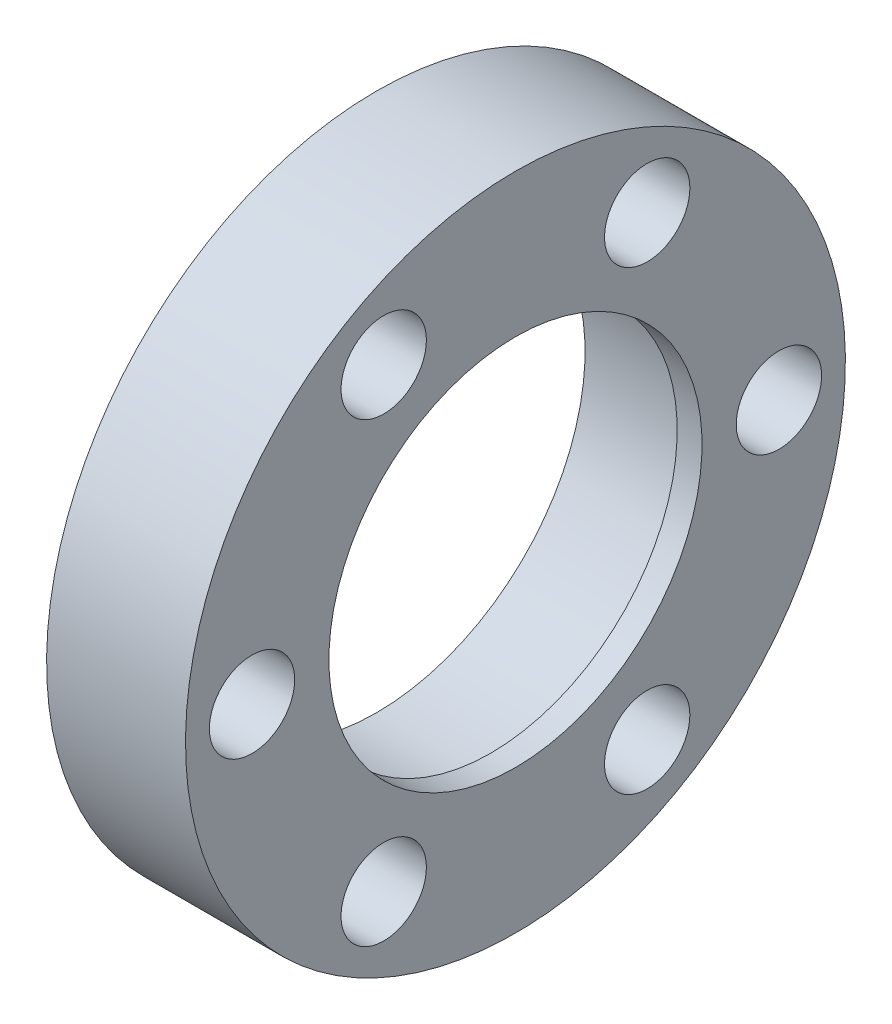
ISO-10303-21;
HEADER;
FILE_DESCRIPTION(('STEP AP214'),'2;1');
FILE_NAME('part.step','',(''),(''),'','','');
FILE_SCHEMA(('AUTOMOTIVE_DESIGN { 1 0 10303 214 1 1 1 1 }'));
ENDSEC;
DATA;
#1=APPLICATION_CONTEXT('core data for automotive mechanical design processes');
#2=APPLICATION_PROTOCOL_DEFINITION('international standard','automotive_design',2000,#1);
#3=PRODUCT_CONTEXT('',#1,'mechanical');
#4=PRODUCT('Part','Part','',(#3));
#5=PRODUCT_RELATED_PRODUCT_CATEGORY('part','',(#4));
#6=PRODUCT_DEFINITION_FORMATION('','',#4);
#7=PRODUCT_DEFINITION_CONTEXT('part definition',#1,'design');
#8=PRODUCT_DEFINITION('design','',#6,#7);
#9=PRODUCT_DEFINITION_SHAPE('','',#8);
#10=(LENGTH_UNIT() NAMED_UNIT(*) SI_UNIT(.MILLI.,.METRE.));
#11=(NAMED_UNIT(*) PLANE_ANGLE_UNIT() SI_UNIT($,.RADIAN.));
#12=(NAMED_UNIT(*) SI_UNIT($,.STERADIAN.) SOLID_ANGLE_UNIT());
#13=UNCERTAINTY_MEASURE_WITH_UNIT(LENGTH_MEASURE(1.E-05),#10,'distance_accuracy_value','');
#14=(GEOMETRIC_REPRESENTATION_CONTEXT(3) GLOBAL_UNCERTAINTY_ASSIGNED_CONTEXT((#13)) GLOBAL_UNIT_ASSIGNED_CONTEXT((#10,
#11,#12)) REPRESENTATION_CONTEXT('',''));
#15=CARTESIAN_POINT('',(0.,0.,0.));
#16=DIRECTION('',(0.,0.,1.));
#17=DIRECTION('',(1.,0.,0.));
#18=AXIS2_PLACEMENT_3D('',#15,#16,#17);
#19=CARTESIAN_POINT('',(5.84199999999898,10.1129000000002,0.));
#20=DIRECTION('',(-1.,0.,0.));
#21=DIRECTION('',(0.,0.,1.));
#22=AXIS2_PLACEMENT_3D('',#19,#20,#21);
#23=PLANE('',#22);
#24=CARTESIAN_POINT('',(5.84199999999899,0.,0.));
#25=DIRECTION('',(1.,0.,0.));
#26=DIRECTION('',(0.,1.,0.));
#27=AXIS2_PLACEMENT_3D('',#24,#25,#26);
#28=CIRCLE('',#27,9.55039999999998);
#29=CARTESIAN_POINT('',(5.84199999999898,9.5504,0.));
#30=VERTEX_POINT('',#29);
#31=EDGE_CURVE('E19',#30,#30,#28,.T.);
#32=ORIENTED_EDGE('',*,*,#31,.T.);
#33=EDGE_LOOP('',(#32));
#34=FACE_BOUND('',#33,.T.);
#35=CARTESIAN_POINT('',(5.84199999999899,0.,0.));
#36=DIRECTION('',(1.,0.,0.));
#37=DIRECTION('',(0.,1.,0.));
#38=AXIS2_PLACEMENT_3D('',#35,#36,#37);
#39=CIRCLE('',#38,10.6754000000004);
#40=CARTESIAN_POINT('',(5.84199999999898,10.6754000000005,0.));
#41=VERTEX_POINT('',#40);
#42=EDGE_CURVE('E71',#41,#41,#39,.F.);
#43=ORIENTED_EDGE('',*,*,#42,.T.);
#44=EDGE_LOOP('',(#43));
#45=FACE_BOUND('',#44,.T.);
#46=ADVANCED_FACE('F15',(#34,#45),#23,.T.);
#47=CARTESIAN_POINT('',(6.47699999999914,0.,0.));
#48=DIRECTION('',(1.,0.,0.));
#49=DIRECTION('',(0.,1.,0.));
#50=AXIS2_PLACEMENT_3D('',#47,#48,#49);
#51=CYLINDRICAL_SURFACE('',#50,9.55039999999998);
#52=CARTESIAN_POINT('',(7.11199999999932,0.,0.));
#53=DIRECTION('',(1.,0.,0.));
#54=DIRECTION('',(0.,1.,0.));
#55=AXIS2_PLACEMENT_3D('',#52,#53,#54);
#56=CIRCLE('',#55,9.55039999999998);
#57=CARTESIAN_POINT('',(7.11199999999932,9.5504,0.));
#58=VERTEX_POINT('',#57);
#59=EDGE_CURVE('E51',#58,#58,#56,.F.);
#60=ORIENTED_EDGE('',*,*,#59,.F.);
#61=EDGE_LOOP('',(#60));
#62=FACE_BOUND('',#61,.T.);
#63=ORIENTED_EDGE('',*,*,#31,.F.);
#64=EDGE_LOOP('',(#63));
#65=FACE_BOUND('',#64,.T.);
#66=ADVANCED_FACE('F79',(#62,#65),#51,.F.);
#67=CARTESIAN_POINT('',(0.,11.6804310310023,-6.7437));
#68=DIRECTION('',(1.,0.,0.));
#69=DIRECTION('',(0.,0.,-1.));
#70=AXIS2_PLACEMENT_3D('',#67,#68,#69);
#71=CYLINDRICAL_SURFACE('',#70,2.18440000000001);
#72=CARTESIAN_POINT('',(0.,11.6804310310023,-6.7437));
#73=DIRECTION('',(1.,0.,0.));
#74=DIRECTION('',(0.,0.,-1.));
#75=AXIS2_PLACEMENT_3D('',#72,#73,#74);
#76=CIRCLE('',#75,2.18440000000001);
#77=CARTESIAN_POINT('',(0.,11.6804310310023,-8.9281));
#78=VERTEX_POINT('',#77);
#79=EDGE_CURVE('E48',#78,#78,#76,.T.);
#80=ORIENTED_EDGE('',*,*,#79,.F.);
#81=EDGE_LOOP('',(#80));
#82=FACE_BOUND('',#81,.T.);
#83=CARTESIAN_POINT('',(7.11199999999932,11.6804310310023,-6.7437));
#84=DIRECTION('',(1.,0.,0.));
#85=DIRECTION('',(0.,0.,-1.));
#86=AXIS2_PLACEMENT_3D('',#83,#84,#85);
#87=CIRCLE('',#86,2.18440000000001);
#88=CARTESIAN_POINT('',(7.11199999999932,11.6804310310023,-8.9281));
#89=VERTEX_POINT('',#88);
#90=EDGE_CURVE('E69',#89,#89,#87,.F.);
#91=ORIENTED_EDGE('',*,*,#90,.F.);
#92=EDGE_LOOP('',(#91));
#93=FACE_BOUND('',#92,.T.);
#94=ADVANCED_FACE('F81',(#82,#93),#71,.F.);
#95=CARTESIAN_POINT('',(0.,0.,-13.4874));
#96=DIRECTION('',(1.,0.,0.));
#97=DIRECTION('',(0.,1.,0.));
#98=AXIS2_PLACEMENT_3D('',#95,#96,#97);
#99=CYLINDRICAL_SURFACE('',#98,2.1844);
#100=CARTESIAN_POINT('',(0.,0.,-13.4874));
#101=DIRECTION('',(1.,0.,0.));
#102=DIRECTION('',(0.,1.,0.));
#103=AXIS2_PLACEMENT_3D('',#100,#101,#102);
#104=CIRCLE('',#103,2.1844);
#105=CARTESIAN_POINT('',(0.,2.18440000000002,-13.4874));
#106=VERTEX_POINT('',#105);
#107=EDGE_CURVE('E45',#106,#106,#104,.T.);
#108=ORIENTED_EDGE('',*,*,#107,.F.);
#109=EDGE_LOOP('',(#108));
#110=FACE_BOUND('',#109,.T.);
#111=CARTESIAN_POINT('',(7.11199999999932,0.,-13.4874));
#112=DIRECTION('',(1.,0.,0.));
#113=DIRECTION('',(0.,1.,0.));
#114=AXIS2_PLACEMENT_3D('',#111,#112,#113);
#115=CIRCLE('',#114,2.1844);
#116=CARTESIAN_POINT('',(7.11199999999932,2.18440000000002,-13.4874));
#117=VERTEX_POINT('',#116);
#118=EDGE_CURVE('E66',#117,#117,#115,.F.);
#119=ORIENTED_EDGE('',*,*,#118,.F.);
#120=EDGE_LOOP('',(#119));
#121=FACE_BOUND('',#120,.T.);
#122=ADVANCED_FACE('F89',(#110,#121),#99,.F.);
#123=CARTESIAN_POINT('',(0.,-11.6804310310022,-6.7437));
#124=DIRECTION('',(1.,0.,0.));
#125=DIRECTION('',(0.,0.,-1.));
#126=AXIS2_PLACEMENT_3D('',#123,#124,#125);
#127=CYLINDRICAL_SURFACE('',#126,2.18440000000001);
#128=CARTESIAN_POINT('',(0.,-11.6804310310022,-6.7437));
#129=DIRECTION('',(1.,0.,0.));
#130=DIRECTION('',(0.,0.,-1.));
#131=AXIS2_PLACEMENT_3D('',#128,#129,#130);
#132=CIRCLE('',#131,2.18440000000001);
#133=CARTESIAN_POINT('',(0.,-11.6804310310022,-8.92810000000001));
#134=VERTEX_POINT('',#133);
#135=EDGE_CURVE('E42',#134,#134,#132,.T.);
#136=ORIENTED_EDGE('',*,*,#135,.F.);
#137=EDGE_LOOP('',(#136));
#138=FACE_BOUND('',#137,.T.);
#139=CARTESIAN_POINT('',(7.11199999999932,-11.6804310310022,-6.7437));
#140=DIRECTION('',(1.,0.,0.));
#141=DIRECTION('',(0.,0.,-1.));
#142=AXIS2_PLACEMENT_3D('',#139,#140,#141);
#143=CIRCLE('',#142,2.18440000000001);
#144=CARTESIAN_POINT('',(7.11199999999932,-11.6804310310022,-8.92810000000001));
#145=VERTEX_POINT('',#144);
#146=EDGE_CURVE('E63',#145,#145,#143,.F.);
#147=ORIENTED_EDGE('',*,*,#146,.F.);
#148=EDGE_LOOP('',(#147));
#149=FACE_BOUND('',#148,.T.);
#150=ADVANCED_FACE('F140',(#138,#149),#127,.F.);
#151=CARTESIAN_POINT('',(0.,-11.6804310310022,6.7437));
#152=DIRECTION('',(1.,0.,0.));
#153=DIRECTION('',(0.,0.,-1.));
#154=AXIS2_PLACEMENT_3D('',#151,#152,#153);
#155=CYLINDRICAL_SURFACE('',#154,2.18440000000001);
#156=CARTESIAN_POINT('',(0.,-11.6804310310022,6.7437));
#157=DIRECTION('',(1.,0.,0.));
#158=DIRECTION('',(0.,0.,-1.));
#159=AXIS2_PLACEMENT_3D('',#156,#157,#158);
#160=CIRCLE('',#159,2.18440000000001);
#161=CARTESIAN_POINT('',(0.,-11.6804310310022,4.55929999999999));
#162=VERTEX_POINT('',#161);
#163=EDGE_CURVE('E39',#162,#162,#160,.T.);
#164=ORIENTED_EDGE('',*,*,#163,.F.);
#165=EDGE_LOOP('',(#164));
#166=FACE_BOUND('',#165,.T.);
#167=CARTESIAN_POINT('',(7.11199999999932,-11.6804310310022,6.7437));
#168=DIRECTION('',(1.,0.,0.));
#169=DIRECTION('',(0.,0.,-1.));
#170=AXIS2_PLACEMENT_3D('',#167,#168,#169);
#171=CIRCLE('',#170,2.18440000000001);
#172=CARTESIAN_POINT('',(7.11199999999932,-11.6804310310022,4.55929999999999));
#173=VERTEX_POINT('',#172);
#174=EDGE_CURVE('E60',#173,#173,#171,.F.);
#175=ORIENTED_EDGE('',*,*,#174,.F.);
#176=EDGE_LOOP('',(#175));
#177=FACE_BOUND('',#176,.T.);
#178=ADVANCED_FACE('F147',(#166,#177),#155,.F.);
#179=CARTESIAN_POINT('',(0.,11.6804310310022,6.74369999999998));
#180=DIRECTION('',(1.,0.,0.));
#181=DIRECTION('',(0.,0.,-1.));
#182=AXIS2_PLACEMENT_3D('',#179,#180,#181);
#183=CYLINDRICAL_SURFACE('',#182,2.18439999999998);
#184=CARTESIAN_POINT('',(0.,11.6804310310022,6.74369999999998));
#185=DIRECTION('',(1.,0.,0.));
#186=DIRECTION('',(0.,0.,-1.));
#187=AXIS2_PLACEMENT_3D('',#184,#185,#186);
#188=CIRCLE('',#187,2.18439999999998);
#189=CARTESIAN_POINT('',(0.,11.6804310310022,4.5593));
#190=VERTEX_POINT('',#189);
#191=EDGE_CURVE('E36',#190,#190,#188,.T.);
#192=ORIENTED_EDGE('',*,*,#191,.F.);
#193=EDGE_LOOP('',(#192));
#194=FACE_BOUND('',#193,.T.);
#195=CARTESIAN_POINT('',(7.11199999999932,11.6804310310022,6.74369999999998));
#196=DIRECTION('',(1.,0.,0.));
#197=DIRECTION('',(0.,0.,-1.));
#198=AXIS2_PLACEMENT_3D('',#195,#196,#197);
#199=CIRCLE('',#198,2.18439999999998);
#200=CARTESIAN_POINT('',(7.11199999999932,11.6804310310022,4.5593));
#201=VERTEX_POINT('',#200);
#202=EDGE_CURVE('E57',#201,#201,#199,.F.);
#203=ORIENTED_EDGE('',*,*,#202,.F.);
#204=EDGE_LOOP('',(#203));
#205=FACE_BOUND('',#204,.T.);
#206=ADVANCED_FACE('F115',(#194,#205),#183,.F.);
#207=CARTESIAN_POINT('',(0.,0.,13.4874));
#208=DIRECTION('',(1.,0.,0.));
#209=DIRECTION('',(0.,1.,0.));
#210=AXIS2_PLACEMENT_3D('',#207,#208,#209);
#211=CYLINDRICAL_SURFACE('',#210,2.1844);
#212=CARTESIAN_POINT('',(0.,0.,13.4874));
#213=DIRECTION('',(1.,0.,0.));
#214=DIRECTION('',(0.,1.,0.));
#215=AXIS2_PLACEMENT_3D('',#212,#213,#214);
#216=CIRCLE('',#215,2.1844);
#217=CARTESIAN_POINT('',(0.,2.18440000000002,13.4874));
#218=VERTEX_POINT('',#217);
#219=EDGE_CURVE('E33',#218,#218,#216,.T.);
#220=ORIENTED_EDGE('',*,*,#219,.F.);
#221=EDGE_LOOP('',(#220));
#222=FACE_BOUND('',#221,.T.);
#223=CARTESIAN_POINT('',(7.11199999999932,0.,13.4874));
#224=DIRECTION('',(1.,0.,0.));
#225=DIRECTION('',(0.,1.,0.));
#226=AXIS2_PLACEMENT_3D('',#223,#224,#225);
#227=CIRCLE('',#226,2.1844);
#228=CARTESIAN_POINT('',(7.11199999999932,2.18440000000002,13.4874));
#229=VERTEX_POINT('',#228);
#230=EDGE_CURVE('E54',#229,#229,#227,.F.);
#231=ORIENTED_EDGE('',*,*,#230,.F.);
#232=EDGE_LOOP('',(#231));
#233=FACE_BOUND('',#232,.T.);
#234=ADVANCED_FACE('F17',(#222,#233),#211,.F.);
#235=CARTESIAN_POINT('',(2.92099999999944,0.,0.));
#236=DIRECTION('',(1.,0.,0.));
#237=DIRECTION('',(0.,1.,0.));
#238=AXIS2_PLACEMENT_3D('',#235,#236,#237);
#239=CYLINDRICAL_SURFACE('',#238,10.6754000000004);
#240=ORIENTED_EDGE('',*,*,#42,.F.);
#241=EDGE_LOOP('',(#240));
#242=FACE_BOUND('',#241,.T.);
#243=CARTESIAN_POINT('',(0.,0.,0.));
#244=DIRECTION('',(1.,0.,0.));
#245=DIRECTION('',(0.,1.,0.));
#246=AXIS2_PLACEMENT_3D('',#243,#244,#245);
#247=CIRCLE('',#246,10.6754000000004);
#248=CARTESIAN_POINT('',(0.,10.6754000000005,0.));
#249=VERTEX_POINT('',#248);
#250=EDGE_CURVE('E28',#249,#249,#247,.T.);
#251=ORIENTED_EDGE('',*,*,#250,.F.);
#252=EDGE_LOOP('',(#251));
#253=FACE_BOUND('',#252,.T.);
#254=ADVANCED_FACE('F108',(#242,#253),#239,.F.);
#255=CARTESIAN_POINT('',(7.11199999999932,13.2207000000003,0.));
#256=DIRECTION('',(1.,0.,0.));
#257=DIRECTION('',(0.,0.,-1.));
#258=AXIS2_PLACEMENT_3D('',#255,#256,#257);
#259=PLANE('',#258);
#260=ORIENTED_EDGE('',*,*,#59,.T.);
#261=EDGE_LOOP('',(#260));
#262=FACE_BOUND('',#261,.T.);
#263=ORIENTED_EDGE('',*,*,#230,.T.);
#264=EDGE_LOOP('',(#263));
#265=FACE_BOUND('',#264,.T.);
#266=ORIENTED_EDGE('',*,*,#202,.T.);
#267=EDGE_LOOP('',(#266));
#268=FACE_BOUND('',#267,.T.);
#269=ORIENTED_EDGE('',*,*,#174,.T.);
#270=EDGE_LOOP('',(#269));
#271=FACE_BOUND('',#270,.T.);
#272=ORIENTED_EDGE('',*,*,#146,.T.);
#273=EDGE_LOOP('',(#272));
#274=FACE_BOUND('',#273,.T.);
#275=ORIENTED_EDGE('',*,*,#118,.T.);
#276=EDGE_LOOP('',(#275));
#277=FACE_BOUND('',#276,.T.);
#278=ORIENTED_EDGE('',*,*,#90,.T.);
#279=EDGE_LOOP('',(#278));
#280=FACE_BOUND('',#279,.T.);
#281=CARTESIAN_POINT('',(7.11199999999932,0.,0.));
#282=DIRECTION('',(1.,0.,0.));
#283=DIRECTION('',(0.,1.,0.));
#284=AXIS2_PLACEMENT_3D('',#281,#282,#283);
#285=CIRCLE('',#284,16.8910000000005);
#286=CARTESIAN_POINT('',(7.11199999999932,16.8910000000005,0.));
#287=VERTEX_POINT('',#286);
#288=EDGE_CURVE('E23',#287,#287,#285,.F.);
#289=ORIENTED_EDGE('',*,*,#288,.F.);
#290=EDGE_LOOP('',(#289));
#291=FACE_BOUND('',#290,.T.);
#292=ADVANCED_FACE('F102',(#262,#265,#268,#271,#274,#277,#280,#291),#259,.T.);
#293=CARTESIAN_POINT('',(0.,13.7832000000005,0.));
#294=DIRECTION('',(-1.,0.,0.));
#295=DIRECTION('',(0.,0.,1.));
#296=AXIS2_PLACEMENT_3D('',#293,#294,#295);
#297=PLANE('',#296);
#298=ORIENTED_EDGE('',*,*,#250,.T.);
#299=EDGE_LOOP('',(#298));
#300=FACE_BOUND('',#299,.T.);
#301=ORIENTED_EDGE('',*,*,#219,.T.);
#302=EDGE_LOOP('',(#301));
#303=FACE_BOUND('',#302,.T.);
#304=ORIENTED_EDGE('',*,*,#191,.T.);
#305=EDGE_LOOP('',(#304));
#306=FACE_BOUND('',#305,.T.);
#307=ORIENTED_EDGE('',*,*,#163,.T.);
#308=EDGE_LOOP('',(#307));
#309=FACE_BOUND('',#308,.T.);
#310=ORIENTED_EDGE('',*,*,#135,.T.);
#311=EDGE_LOOP('',(#310));
#312=FACE_BOUND('',#311,.T.);
#313=ORIENTED_EDGE('',*,*,#107,.T.);
#314=EDGE_LOOP('',(#313));
#315=FACE_BOUND('',#314,.T.);
#316=ORIENTED_EDGE('',*,*,#79,.T.);
#317=EDGE_LOOP('',(#316));
#318=FACE_BOUND('',#317,.T.);
#319=CARTESIAN_POINT('',(0.,0.,0.));
#320=DIRECTION('',(1.,0.,0.));
#321=DIRECTION('',(0.,1.,0.));
#322=AXIS2_PLACEMENT_3D('',#319,#320,#321);
#323=CIRCLE('',#322,16.8910000000005);
#324=CARTESIAN_POINT('',(0.,16.8910000000005,0.));
#325=VERTEX_POINT('',#324);
#326=EDGE_CURVE('E10',#325,#325,#323,.T.);
#327=ORIENTED_EDGE('',*,*,#326,.F.);
#328=EDGE_LOOP('',(#327));
#329=FACE_BOUND('',#328,.T.);
#330=ADVANCED_FACE('F97',(#300,#303,#306,#309,#312,#315,#318,#329),#297,.T.);
#331=CARTESIAN_POINT('',(3.55599999999962,0.,0.));
#332=DIRECTION('',(1.,0.,0.));
#333=DIRECTION('',(0.,1.,0.));
#334=AXIS2_PLACEMENT_3D('',#331,#332,#333);
#335=CYLINDRICAL_SURFACE('',#334,16.8910000000005);
#336=ORIENTED_EDGE('',*,*,#326,.T.);
#337=EDGE_LOOP('',(#336));
#338=FACE_BOUND('',#337,.T.);
#339=ORIENTED_EDGE('',*,*,#288,.T.);
#340=EDGE_LOOP('',(#339));
#341=FACE_BOUND('',#340,.T.);
#342=ADVANCED_FACE('F95',(#338,#341),#335,.T.);
#343=CLOSED_SHELL('',(#46,#66,#94,#122,#150,#178,#206,#234,#254,#292,#330,#342));
#344=MANIFOLD_SOLID_BREP('B1',#343);
#345=ADVANCED_BREP_SHAPE_REPRESENTATION('',(#18,#344),#14);
#346=SHAPE_DEFINITION_REPRESENTATION(#9,#345);
ENDSEC;
END-ISO-10303-21;
